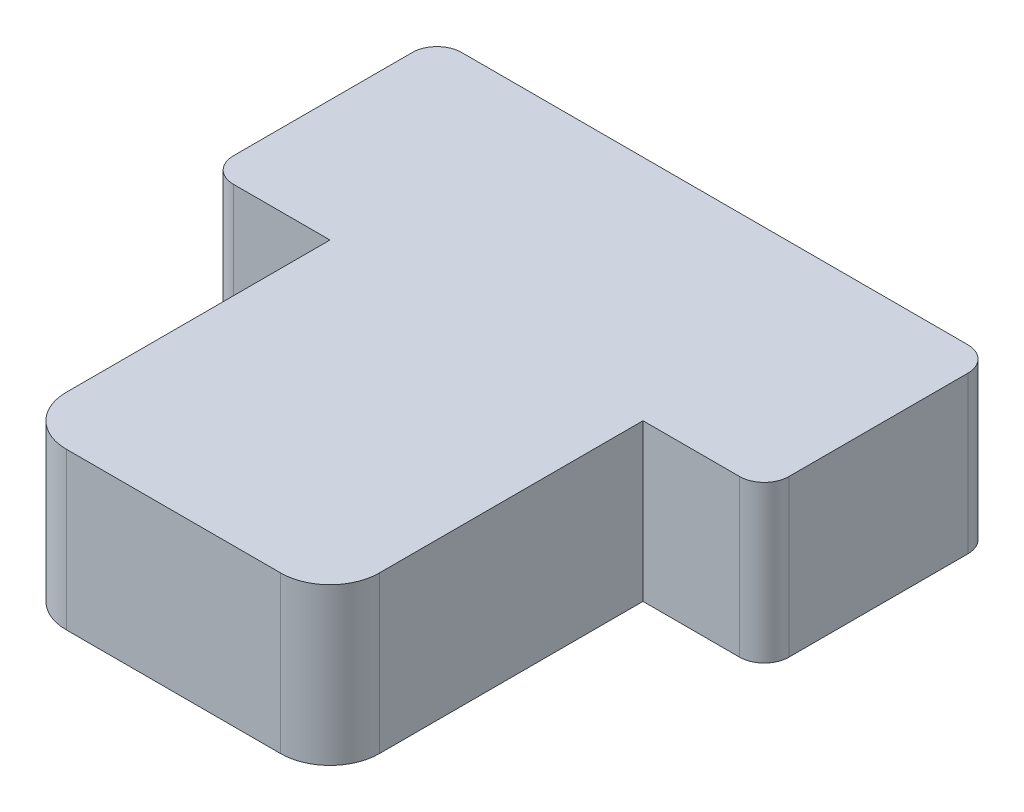
ISO-10303-21;
HEADER;
FILE_DESCRIPTION(('STEP AP214'),'2;1');
FILE_NAME('part.step','',(''),(''),'','','');
FILE_SCHEMA(('AUTOMOTIVE_DESIGN { 1 0 10303 214 1 1 1 1 }'));
ENDSEC;
DATA;
#1=APPLICATION_CONTEXT('core data for automotive mechanical design processes');
#2=APPLICATION_PROTOCOL_DEFINITION('international standard','automotive_design',2000,#1);
#3=PRODUCT_CONTEXT('',#1,'mechanical');
#4=PRODUCT('Part','Part','',(#3));
#5=PRODUCT_RELATED_PRODUCT_CATEGORY('part','',(#4));
#6=PRODUCT_DEFINITION_FORMATION('','',#4);
#7=PRODUCT_DEFINITION_CONTEXT('part definition',#1,'design');
#8=PRODUCT_DEFINITION('design','',#6,#7);
#9=PRODUCT_DEFINITION_SHAPE('','',#8);
#10=(LENGTH_UNIT() NAMED_UNIT(*) SI_UNIT(.MILLI.,.METRE.));
#11=(NAMED_UNIT(*) PLANE_ANGLE_UNIT() SI_UNIT($,.RADIAN.));
#12=(NAMED_UNIT(*) SI_UNIT($,.STERADIAN.) SOLID_ANGLE_UNIT());
#13=UNCERTAINTY_MEASURE_WITH_UNIT(LENGTH_MEASURE(1.E-05),#10,'distance_accuracy_value','');
#14=(GEOMETRIC_REPRESENTATION_CONTEXT(3) GLOBAL_UNCERTAINTY_ASSIGNED_CONTEXT((#13)) GLOBAL_UNIT_ASSIGNED_CONTEXT((#10,
#11,#12)) REPRESENTATION_CONTEXT('',''));
#15=CARTESIAN_POINT('',(0.,0.,0.));
#16=DIRECTION('',(0.,0.,1.));
#17=DIRECTION('',(1.,0.,0.));
#18=AXIS2_PLACEMENT_3D('',#15,#16,#17);
#19=CARTESIAN_POINT('',(0.,3.175,0.));
#20=DIRECTION('',(1.,0.,0.));
#21=DIRECTION('',(0.,0.,-1.));
#22=AXIS2_PLACEMENT_3D('',#19,#20,#21);
#23=PLANE('',#22);
#24=DIRECTION('',(0.,0.,1.));
#25=VECTOR('',#24,1.);
#26=CARTESIAN_POINT('',(0.,0.,0.));
#27=LINE('',#26,#25);
#28=CARTESIAN_POINT('',(0.,0.,-6.35));
#29=VERTEX_POINT('',#28);
#30=CARTESIAN_POINT('',(0.,0.,-1.));
#31=VERTEX_POINT('',#30);
#32=EDGE_CURVE('E174',#29,#31,#27,.T.);
#33=ORIENTED_EDGE('',*,*,#32,.T.);
#34=DIRECTION('',(0.,-1.,0.));
#35=VECTOR('',#34,1.);
#36=CARTESIAN_POINT('',(0.,3.175,-1.));
#37=LINE('',#36,#35);
#38=CARTESIAN_POINT('',(0.,3.175,-1.));
#39=VERTEX_POINT('',#38);
#40=EDGE_CURVE('E204',#31,#39,#37,.F.);
#41=ORIENTED_EDGE('',*,*,#40,.T.);
#42=DIRECTION('',(0.,0.,1.));
#43=VECTOR('',#42,1.);
#44=CARTESIAN_POINT('',(0.,3.175,0.));
#45=LINE('',#44,#43);
#46=CARTESIAN_POINT('',(0.,3.175,-6.35));
#47=VERTEX_POINT('',#46);
#48=EDGE_CURVE('E193',#47,#39,#45,.T.);
#49=ORIENTED_EDGE('',*,*,#48,.F.);
#50=DIRECTION('',(0.,-1.,0.));
#51=VECTOR('',#50,1.);
#52=CARTESIAN_POINT('',(0.,3.175,-6.35));
#53=LINE('',#52,#51);
#54=EDGE_CURVE('E159',#47,#29,#53,.T.);
#55=ORIENTED_EDGE('',*,*,#54,.T.);
#56=EDGE_LOOP('',(#33,#41,#49,#55));
#57=FACE_BOUND('',#56,.T.);
#58=ADVANCED_FACE('F34',(#57),#23,.F.);
#59=CARTESIAN_POINT('',(0.,3.175,0.));
#60=DIRECTION('',(0.,0.,-1.));
#61=DIRECTION('',(-1.,0.,0.));
#62=AXIS2_PLACEMENT_3D('',#59,#60,#61);
#63=PLANE('',#62);
#64=DIRECTION('',(1.,0.,0.));
#65=VECTOR('',#64,1.);
#66=CARTESIAN_POINT('',(0.,3.175,0.));
#67=LINE('',#66,#65);
#68=CARTESIAN_POINT('',(0.999999999999999,3.175,0.));
#69=VERTEX_POINT('',#68);
#70=CARTESIAN_POINT('',(5.35,3.175,0.));
#71=VERTEX_POINT('',#70);
#72=EDGE_CURVE('E148',#69,#71,#67,.T.);
#73=ORIENTED_EDGE('',*,*,#72,.F.);
#74=DIRECTION('',(0.,-1.,0.));
#75=VECTOR('',#74,1.);
#76=CARTESIAN_POINT('',(1.,3.175,0.));
#77=LINE('',#76,#75);
#78=CARTESIAN_POINT('',(0.999999999999999,0.,0.));
#79=VERTEX_POINT('',#78);
#80=EDGE_CURVE('E197',#69,#79,#77,.T.);
#81=ORIENTED_EDGE('',*,*,#80,.T.);
#82=DIRECTION('',(1.,0.,0.));
#83=VECTOR('',#82,1.);
#84=CARTESIAN_POINT('',(0.,0.,0.));
#85=LINE('',#84,#83);
#86=CARTESIAN_POINT('',(5.35,0.,0.));
#87=VERTEX_POINT('',#86);
#88=EDGE_CURVE('E177',#79,#87,#85,.T.);
#89=ORIENTED_EDGE('',*,*,#88,.T.);
#90=DIRECTION('',(0.,-1.,0.));
#91=VECTOR('',#90,1.);
#92=CARTESIAN_POINT('',(5.35,3.175,0.));
#93=LINE('',#92,#91);
#94=EDGE_CURVE('E158',#87,#71,#93,.F.);
#95=ORIENTED_EDGE('',*,*,#94,.T.);
#96=EDGE_LOOP('',(#73,#81,#89,#95));
#97=FACE_BOUND('',#96,.T.);
#98=ADVANCED_FACE('F283',(#97),#63,.F.);
#99=CARTESIAN_POINT('',(6.35,3.175,0.));
#100=DIRECTION('',(-1.,0.,0.));
#101=DIRECTION('',(0.,0.,1.));
#102=AXIS2_PLACEMENT_3D('',#99,#100,#101);
#103=PLANE('',#102);
#104=DIRECTION('',(0.,0.,-1.));
#105=VECTOR('',#104,1.);
#106=CARTESIAN_POINT('',(6.35,3.175,0.));
#107=LINE('',#106,#105);
#108=CARTESIAN_POINT('',(6.35,3.175,-1.));
#109=VERTEX_POINT('',#108);
#110=CARTESIAN_POINT('',(6.35,3.175,-6.35));
#111=VERTEX_POINT('',#110);
#112=EDGE_CURVE('E135',#109,#111,#107,.T.);
#113=ORIENTED_EDGE('',*,*,#112,.F.);
#114=DIRECTION('',(0.,-1.,0.));
#115=VECTOR('',#114,1.);
#116=CARTESIAN_POINT('',(6.35,3.175,-1.));
#117=LINE('',#116,#115);
#118=CARTESIAN_POINT('',(6.35,0.,-1.));
#119=VERTEX_POINT('',#118);
#120=EDGE_CURVE('E209',#109,#119,#117,.T.);
#121=ORIENTED_EDGE('',*,*,#120,.T.);
#122=DIRECTION('',(0.,0.,-1.));
#123=VECTOR('',#122,1.);
#124=CARTESIAN_POINT('',(6.35,0.,0.));
#125=LINE('',#124,#123);
#126=CARTESIAN_POINT('',(6.35,0.,-6.35));
#127=VERTEX_POINT('',#126);
#128=EDGE_CURVE('E154',#119,#127,#125,.T.);
#129=ORIENTED_EDGE('',*,*,#128,.T.);
#130=DIRECTION('',(0.,-1.,0.));
#131=VECTOR('',#130,1.);
#132=CARTESIAN_POINT('',(6.35,3.175,-6.35));
#133=LINE('',#132,#131);
#134=EDGE_CURVE('E151',#111,#127,#133,.T.);
#135=ORIENTED_EDGE('',*,*,#134,.F.);
#136=EDGE_LOOP('',(#113,#121,#129,#135));
#137=FACE_BOUND('',#136,.T.);
#138=ADVANCED_FACE('F152',(#137),#103,.F.);
#139=CARTESIAN_POINT('',(6.35,3.175,-6.35));
#140=DIRECTION('',(0.,0.,-1.));
#141=DIRECTION('',(-1.,0.,0.));
#142=AXIS2_PLACEMENT_3D('',#139,#140,#141);
#143=PLANE('',#142);
#144=DIRECTION('',(1.,0.,0.));
#145=VECTOR('',#144,1.);
#146=CARTESIAN_POINT('',(6.35,0.,-6.35));
#147=LINE('',#146,#145);
#148=CARTESIAN_POINT('',(8.31,0.,-6.35));
#149=VERTEX_POINT('',#148);
#150=EDGE_CURVE('E181',#127,#149,#147,.T.);
#151=ORIENTED_EDGE('',*,*,#150,.T.);
#152=DIRECTION('',(0.,-1.,0.));
#153=VECTOR('',#152,1.);
#154=CARTESIAN_POINT('',(8.31,3.175,-6.35));
#155=LINE('',#154,#153);
#156=CARTESIAN_POINT('',(8.31,3.175,-6.35));
#157=VERTEX_POINT('',#156);
#158=EDGE_CURVE('E11',#149,#157,#155,.F.);
#159=ORIENTED_EDGE('',*,*,#158,.T.);
#160=DIRECTION('',(1.,0.,0.));
#161=VECTOR('',#160,1.);
#162=CARTESIAN_POINT('',(6.35,3.175,-6.35));
#163=LINE('',#162,#161);
#164=EDGE_CURVE('E140',#111,#157,#163,.T.);
#165=ORIENTED_EDGE('',*,*,#164,.F.);
#166=ORIENTED_EDGE('',*,*,#134,.T.);
#167=EDGE_LOOP('',(#151,#159,#165,#166));
#168=FACE_BOUND('',#167,.T.);
#169=ADVANCED_FACE('F161',(#168),#143,.F.);
#170=CARTESIAN_POINT('',(8.81,3.175,-10.9807274));
#171=DIRECTION('',(-1.,0.,0.));
#172=DIRECTION('',(0.,0.,1.));
#173=AXIS2_PLACEMENT_3D('',#170,#171,#172);
#174=PLANE('',#173);
#175=DIRECTION('',(0.,0.,-1.));
#176=VECTOR('',#175,1.);
#177=CARTESIAN_POINT('',(8.81,0.,-10.9807274));
#178=LINE('',#177,#176);
#179=CARTESIAN_POINT('',(8.81,0.,-6.85));
#180=VERTEX_POINT('',#179);
#181=CARTESIAN_POINT('',(8.81,0.,-10.4807274));
#182=VERTEX_POINT('',#181);
#183=EDGE_CURVE('E183',#180,#182,#178,.T.);
#184=ORIENTED_EDGE('',*,*,#183,.T.);
#185=DIRECTION('',(0.,-1.,0.));
#186=VECTOR('',#185,1.);
#187=CARTESIAN_POINT('',(8.81,3.175,-10.4807274));
#188=LINE('',#187,#186);
#189=CARTESIAN_POINT('',(8.81,3.175,-10.4807274));
#190=VERTEX_POINT('',#189);
#191=EDGE_CURVE('E42',#182,#190,#188,.F.);
#192=ORIENTED_EDGE('',*,*,#191,.T.);
#193=DIRECTION('',(0.,0.,-1.));
#194=VECTOR('',#193,1.);
#195=CARTESIAN_POINT('',(8.81,3.175,-10.9807274));
#196=LINE('',#195,#194);
#197=CARTESIAN_POINT('',(8.81,3.175,-6.85));
#198=VERTEX_POINT('',#197);
#199=EDGE_CURVE('E163',#198,#190,#196,.T.);
#200=ORIENTED_EDGE('',*,*,#199,.F.);
#201=DIRECTION('',(0.,-1.,0.));
#202=VECTOR('',#201,1.);
#203=CARTESIAN_POINT('',(8.81,3.175,-6.85));
#204=LINE('',#203,#202);
#205=EDGE_CURVE('E238',#198,#180,#204,.T.);
#206=ORIENTED_EDGE('',*,*,#205,.T.);
#207=EDGE_LOOP('',(#184,#192,#200,#206));
#208=FACE_BOUND('',#207,.T.);
#209=ADVANCED_FACE('F243',(#208),#174,.F.);
#210=CARTESIAN_POINT('',(-2.46,3.175,-10.9807274));
#211=DIRECTION('',(0.,0.,1.));
#212=DIRECTION('',(1.,0.,0.));
#213=AXIS2_PLACEMENT_3D('',#210,#211,#212);
#214=PLANE('',#213);
#215=DIRECTION('',(-1.,0.,0.));
#216=VECTOR('',#215,1.);
#217=CARTESIAN_POINT('',(-2.46,0.,-10.9807274));
#218=LINE('',#217,#216);
#219=CARTESIAN_POINT('',(8.31,0.,-10.9807274));
#220=VERTEX_POINT('',#219);
#221=CARTESIAN_POINT('',(-1.96,0.,-10.9807274));
#222=VERTEX_POINT('',#221);
#223=EDGE_CURVE('E186',#220,#222,#218,.T.);
#224=ORIENTED_EDGE('',*,*,#223,.T.);
#225=DIRECTION('',(0.,-1.,0.));
#226=VECTOR('',#225,1.);
#227=CARTESIAN_POINT('',(-1.96,3.175,-10.9807274));
#228=LINE('',#227,#226);
#229=CARTESIAN_POINT('',(-1.96,3.175,-10.9807274));
#230=VERTEX_POINT('',#229);
#231=EDGE_CURVE('E49',#222,#230,#228,.F.);
#232=ORIENTED_EDGE('',*,*,#231,.T.);
#233=DIRECTION('',(-1.,0.,0.));
#234=VECTOR('',#233,1.);
#235=CARTESIAN_POINT('',(-2.46,3.175,-10.9807274));
#236=LINE('',#235,#234);
#237=CARTESIAN_POINT('',(8.31,3.175,-10.9807274));
#238=VERTEX_POINT('',#237);
#239=EDGE_CURVE('E165',#238,#230,#236,.T.);
#240=ORIENTED_EDGE('',*,*,#239,.F.);
#241=DIRECTION('',(0.,-1.,0.));
#242=VECTOR('',#241,1.);
#243=CARTESIAN_POINT('',(8.31,3.175,-10.9807274));
#244=LINE('',#243,#242);
#245=EDGE_CURVE('E234',#238,#220,#244,.T.);
#246=ORIENTED_EDGE('',*,*,#245,.T.);
#247=EDGE_LOOP('',(#224,#232,#240,#246));
#248=FACE_BOUND('',#247,.T.);
#249=ADVANCED_FACE('F250',(#248),#214,.F.);
#250=CARTESIAN_POINT('',(-2.46,3.175,-10.9807274));
#251=DIRECTION('',(1.,0.,0.));
#252=DIRECTION('',(0.,0.,-1.));
#253=AXIS2_PLACEMENT_3D('',#250,#251,#252);
#254=PLANE('',#253);
#255=DIRECTION('',(0.,0.,1.));
#256=VECTOR('',#255,1.);
#257=CARTESIAN_POINT('',(-2.46,0.,-10.9807274));
#258=LINE('',#257,#256);
#259=CARTESIAN_POINT('',(-2.46,0.,-10.4807274));
#260=VERTEX_POINT('',#259);
#261=CARTESIAN_POINT('',(-2.46,0.,-6.85));
#262=VERTEX_POINT('',#261);
#263=EDGE_CURVE('E188',#260,#262,#258,.T.);
#264=ORIENTED_EDGE('',*,*,#263,.T.);
#265=DIRECTION('',(0.,-1.,0.));
#266=VECTOR('',#265,1.);
#267=CARTESIAN_POINT('',(-2.46,3.175,-6.85));
#268=LINE('',#267,#266);
#269=CARTESIAN_POINT('',(-2.46,3.175,-6.85));
#270=VERTEX_POINT('',#269);
#271=EDGE_CURVE('E225',#262,#270,#268,.F.);
#272=ORIENTED_EDGE('',*,*,#271,.T.);
#273=DIRECTION('',(0.,0.,1.));
#274=VECTOR('',#273,1.);
#275=CARTESIAN_POINT('',(-2.46,3.175,-10.9807274));
#276=LINE('',#275,#274);
#277=CARTESIAN_POINT('',(-2.46,3.175,-10.4807274));
#278=VERTEX_POINT('',#277);
#279=EDGE_CURVE('E170',#278,#270,#276,.T.);
#280=ORIENTED_EDGE('',*,*,#279,.F.);
#281=DIRECTION('',(0.,-1.,0.));
#282=VECTOR('',#281,1.);
#283=CARTESIAN_POINT('',(-2.46,3.175,-10.4807274));
#284=LINE('',#283,#282);
#285=EDGE_CURVE('E222',#278,#260,#284,.T.);
#286=ORIENTED_EDGE('',*,*,#285,.T.);
#287=EDGE_LOOP('',(#264,#272,#280,#286));
#288=FACE_BOUND('',#287,.T.);
#289=ADVANCED_FACE('F261',(#288),#254,.F.);
#290=CARTESIAN_POINT('',(-2.46,3.175,-6.35));
#291=DIRECTION('',(0.,0.,-1.));
#292=DIRECTION('',(-1.,0.,0.));
#293=AXIS2_PLACEMENT_3D('',#290,#291,#292);
#294=PLANE('',#293);
#295=DIRECTION('',(1.,0.,0.));
#296=VECTOR('',#295,1.);
#297=CARTESIAN_POINT('',(-2.46,3.175,-6.35));
#298=LINE('',#297,#296);
#299=CARTESIAN_POINT('',(-1.96,3.175,-6.35));
#300=VERTEX_POINT('',#299);
#301=EDGE_CURVE('E172',#300,#47,#298,.T.);
#302=ORIENTED_EDGE('',*,*,#301,.F.);
#303=DIRECTION('',(0.,-1.,0.));
#304=VECTOR('',#303,1.);
#305=CARTESIAN_POINT('',(-1.96,3.175,-6.35));
#306=LINE('',#305,#304);
#307=CARTESIAN_POINT('',(-1.96,0.,-6.35));
#308=VERTEX_POINT('',#307);
#309=EDGE_CURVE('E211',#300,#308,#306,.T.);
#310=ORIENTED_EDGE('',*,*,#309,.T.);
#311=DIRECTION('',(1.,0.,0.));
#312=VECTOR('',#311,1.);
#313=CARTESIAN_POINT('',(-2.46,0.,-6.35));
#314=LINE('',#313,#312);
#315=EDGE_CURVE('E191',#308,#29,#314,.T.);
#316=ORIENTED_EDGE('',*,*,#315,.T.);
#317=ORIENTED_EDGE('',*,*,#54,.F.);
#318=EDGE_LOOP('',(#302,#310,#316,#317));
#319=FACE_BOUND('',#318,.T.);
#320=ADVANCED_FACE('F269',(#319),#294,.F.);
#321=CARTESIAN_POINT('',(0.,3.175,0.));
#322=DIRECTION('',(0.,-1.,0.));
#323=DIRECTION('',(0.,0.,-1.));
#324=AXIS2_PLACEMENT_3D('',#321,#322,#323);
#325=PLANE('',#324);
#326=ORIENTED_EDGE('',*,*,#279,.T.);
#327=CARTESIAN_POINT('',(-1.96,3.175,-6.85));
#328=DIRECTION('',(0.,-1.,0.));
#329=DIRECTION('',(0.,0.,-1.));
#330=AXIS2_PLACEMENT_3D('',#327,#328,#329);
#331=CIRCLE('',#330,0.5);
#332=EDGE_CURVE('E232',#270,#300,#331,.F.);
#333=ORIENTED_EDGE('',*,*,#332,.T.);
#334=ORIENTED_EDGE('',*,*,#301,.T.);
#335=ORIENTED_EDGE('',*,*,#48,.T.);
#336=CARTESIAN_POINT('',(1.,3.175,-1.));
#337=DIRECTION('',(0.,-1.,0.));
#338=DIRECTION('',(0.,0.,-1.));
#339=AXIS2_PLACEMENT_3D('',#336,#337,#338);
#340=CIRCLE('',#339,1.);
#341=EDGE_CURVE('E207',#39,#69,#340,.F.);
#342=ORIENTED_EDGE('',*,*,#341,.T.);
#343=ORIENTED_EDGE('',*,*,#72,.T.);
#344=CARTESIAN_POINT('',(5.35,3.175,-1.));
#345=DIRECTION('',(0.,-1.,0.));
#346=DIRECTION('',(0.,0.,-1.));
#347=AXIS2_PLACEMENT_3D('',#344,#345,#346);
#348=CIRCLE('',#347,1.);
#349=EDGE_CURVE('E144',#71,#109,#348,.F.);
#350=ORIENTED_EDGE('',*,*,#349,.T.);
#351=ORIENTED_EDGE('',*,*,#112,.T.);
#352=ORIENTED_EDGE('',*,*,#164,.T.);
#353=CARTESIAN_POINT('',(8.31,3.175,-6.85));
#354=DIRECTION('',(0.,-1.,0.));
#355=DIRECTION('',(0.,0.,-1.));
#356=AXIS2_PLACEMENT_3D('',#353,#354,#355);
#357=CIRCLE('',#356,0.5);
#358=EDGE_CURVE('E227',#157,#198,#357,.F.);
#359=ORIENTED_EDGE('',*,*,#358,.T.);
#360=ORIENTED_EDGE('',*,*,#199,.T.);
#361=CARTESIAN_POINT('',(8.31,3.175,-10.4807274));
#362=DIRECTION('',(0.,-1.,0.));
#363=DIRECTION('',(0.,0.,-1.));
#364=AXIS2_PLACEMENT_3D('',#361,#362,#363);
#365=CIRCLE('',#364,0.5);
#366=EDGE_CURVE('E56',#190,#238,#365,.F.);
#367=ORIENTED_EDGE('',*,*,#366,.T.);
#368=ORIENTED_EDGE('',*,*,#239,.T.);
#369=CARTESIAN_POINT('',(-1.96,3.175,-10.4807274));
#370=DIRECTION('',(0.,-1.,0.));
#371=DIRECTION('',(0.,0.,-1.));
#372=AXIS2_PLACEMENT_3D('',#369,#370,#371);
#373=CIRCLE('',#372,0.5);
#374=EDGE_CURVE('E230',#230,#278,#373,.F.);
#375=ORIENTED_EDGE('',*,*,#374,.T.);
#376=EDGE_LOOP('',(#326,#333,#334,#335,#342,#343,#350,#351,#352,#359,#360,#367,#368,#375));
#377=FACE_BOUND('',#376,.T.);
#378=ADVANCED_FACE('F138',(#377),#325,.F.);
#379=CARTESIAN_POINT('',(0.,0.,0.));
#380=DIRECTION('',(0.,-1.,0.));
#381=DIRECTION('',(0.,0.,-1.));
#382=AXIS2_PLACEMENT_3D('',#379,#380,#381);
#383=PLANE('',#382);
#384=ORIENTED_EDGE('',*,*,#315,.F.);
#385=CARTESIAN_POINT('',(-1.96,0.,-6.85));
#386=DIRECTION('',(0.,-1.,0.));
#387=DIRECTION('',(0.,0.,-1.));
#388=AXIS2_PLACEMENT_3D('',#385,#386,#387);
#389=CIRCLE('',#388,0.5);
#390=EDGE_CURVE('E220',#308,#262,#389,.T.);
#391=ORIENTED_EDGE('',*,*,#390,.T.);
#392=ORIENTED_EDGE('',*,*,#263,.F.);
#393=CARTESIAN_POINT('',(-1.96,0.,-10.4807274));
#394=DIRECTION('',(0.,-1.,0.));
#395=DIRECTION('',(0.,0.,-1.));
#396=AXIS2_PLACEMENT_3D('',#393,#394,#395);
#397=CIRCLE('',#396,0.5);
#398=EDGE_CURVE('E218',#260,#222,#397,.T.);
#399=ORIENTED_EDGE('',*,*,#398,.T.);
#400=ORIENTED_EDGE('',*,*,#223,.F.);
#401=CARTESIAN_POINT('',(8.31,0.,-10.4807274));
#402=DIRECTION('',(0.,-1.,0.));
#403=DIRECTION('',(0.,0.,-1.));
#404=AXIS2_PLACEMENT_3D('',#401,#402,#403);
#405=CIRCLE('',#404,0.5);
#406=EDGE_CURVE('E216',#220,#182,#405,.T.);
#407=ORIENTED_EDGE('',*,*,#406,.T.);
#408=ORIENTED_EDGE('',*,*,#183,.F.);
#409=CARTESIAN_POINT('',(8.31,0.,-6.85));
#410=DIRECTION('',(0.,-1.,0.));
#411=DIRECTION('',(0.,0.,-1.));
#412=AXIS2_PLACEMENT_3D('',#409,#410,#411);
#413=CIRCLE('',#412,0.5);
#414=EDGE_CURVE('E214',#180,#149,#413,.T.);
#415=ORIENTED_EDGE('',*,*,#414,.T.);
#416=ORIENTED_EDGE('',*,*,#150,.F.);
#417=ORIENTED_EDGE('',*,*,#128,.F.);
#418=CARTESIAN_POINT('',(5.35,0.,-1.));
#419=DIRECTION('',(0.,-1.,0.));
#420=DIRECTION('',(0.,0.,-1.));
#421=AXIS2_PLACEMENT_3D('',#418,#419,#420);
#422=CIRCLE('',#421,1.);
#423=EDGE_CURVE('E200',#119,#87,#422,.T.);
#424=ORIENTED_EDGE('',*,*,#423,.T.);
#425=ORIENTED_EDGE('',*,*,#88,.F.);
#426=CARTESIAN_POINT('',(1.,0.,-1.));
#427=DIRECTION('',(0.,-1.,0.));
#428=DIRECTION('',(0.,0.,-1.));
#429=AXIS2_PLACEMENT_3D('',#426,#427,#428);
#430=CIRCLE('',#429,1.);
#431=EDGE_CURVE('E202',#79,#31,#430,.T.);
#432=ORIENTED_EDGE('',*,*,#431,.T.);
#433=ORIENTED_EDGE('',*,*,#32,.F.);
#434=EDGE_LOOP('',(#384,#391,#392,#399,#400,#407,#408,#415,#416,#417,#424,#425,#432,#433));
#435=FACE_BOUND('',#434,.T.);
#436=ADVANCED_FACE('F253',(#435),#383,.T.);
#437=CARTESIAN_POINT('',(1.,3.175,-1.));
#438=DIRECTION('',(0.,-1.,0.));
#439=DIRECTION('',(0.,0.,-1.));
#440=AXIS2_PLACEMENT_3D('',#437,#438,#439);
#441=CYLINDRICAL_SURFACE('',#440,1.);
#442=ORIENTED_EDGE('',*,*,#341,.F.);
#443=ORIENTED_EDGE('',*,*,#40,.F.);
#444=ORIENTED_EDGE('',*,*,#431,.F.);
#445=ORIENTED_EDGE('',*,*,#80,.F.);
#446=EDGE_LOOP('',(#442,#443,#444,#445));
#447=FACE_BOUND('',#446,.T.);
#448=ADVANCED_FACE('F279',(#447),#441,.T.);
#449=CARTESIAN_POINT('',(5.35,3.175,-1.));
#450=DIRECTION('',(0.,-1.,0.));
#451=DIRECTION('',(0.,0.,-1.));
#452=AXIS2_PLACEMENT_3D('',#449,#450,#451);
#453=CYLINDRICAL_SURFACE('',#452,1.);
#454=ORIENTED_EDGE('',*,*,#349,.F.);
#455=ORIENTED_EDGE('',*,*,#94,.F.);
#456=ORIENTED_EDGE('',*,*,#423,.F.);
#457=ORIENTED_EDGE('',*,*,#120,.F.);
#458=EDGE_LOOP('',(#454,#455,#456,#457));
#459=FACE_BOUND('',#458,.T.);
#460=ADVANCED_FACE('F287',(#459),#453,.T.);
#461=CARTESIAN_POINT('',(-1.96,3.175,-6.85));
#462=DIRECTION('',(0.,-1.,0.));
#463=DIRECTION('',(0.,0.,-1.));
#464=AXIS2_PLACEMENT_3D('',#461,#462,#463);
#465=CYLINDRICAL_SURFACE('',#464,0.5);
#466=ORIENTED_EDGE('',*,*,#332,.F.);
#467=ORIENTED_EDGE('',*,*,#271,.F.);
#468=ORIENTED_EDGE('',*,*,#390,.F.);
#469=ORIENTED_EDGE('',*,*,#309,.F.);
#470=EDGE_LOOP('',(#466,#467,#468,#469));
#471=FACE_BOUND('',#470,.T.);
#472=ADVANCED_FACE('F267',(#471),#465,.T.);
#473=CARTESIAN_POINT('',(-1.96,3.175,-10.4807274));
#474=DIRECTION('',(0.,-1.,0.));
#475=DIRECTION('',(0.,0.,-1.));
#476=AXIS2_PLACEMENT_3D('',#473,#474,#475);
#477=CYLINDRICAL_SURFACE('',#476,0.5);
#478=ORIENTED_EDGE('',*,*,#374,.F.);
#479=ORIENTED_EDGE('',*,*,#231,.F.);
#480=ORIENTED_EDGE('',*,*,#398,.F.);
#481=ORIENTED_EDGE('',*,*,#285,.F.);
#482=EDGE_LOOP('',(#478,#479,#480,#481));
#483=FACE_BOUND('',#482,.T.);
#484=ADVANCED_FACE('F258',(#483),#477,.T.);
#485=CARTESIAN_POINT('',(8.31,3.175,-10.4807274));
#486=DIRECTION('',(0.,-1.,0.));
#487=DIRECTION('',(0.,0.,-1.));
#488=AXIS2_PLACEMENT_3D('',#485,#486,#487);
#489=CYLINDRICAL_SURFACE('',#488,0.5);
#490=ORIENTED_EDGE('',*,*,#366,.F.);
#491=ORIENTED_EDGE('',*,*,#191,.F.);
#492=ORIENTED_EDGE('',*,*,#406,.F.);
#493=ORIENTED_EDGE('',*,*,#245,.F.);
#494=EDGE_LOOP('',(#490,#491,#492,#493));
#495=FACE_BOUND('',#494,.T.);
#496=ADVANCED_FACE('F248',(#495),#489,.T.);
#497=CARTESIAN_POINT('',(8.31,3.175,-6.85));
#498=DIRECTION('',(0.,-1.,0.));
#499=DIRECTION('',(0.,0.,-1.));
#500=AXIS2_PLACEMENT_3D('',#497,#498,#499);
#501=CYLINDRICAL_SURFACE('',#500,0.5);
#502=ORIENTED_EDGE('',*,*,#358,.F.);
#503=ORIENTED_EDGE('',*,*,#158,.F.);
#504=ORIENTED_EDGE('',*,*,#414,.F.);
#505=ORIENTED_EDGE('',*,*,#205,.F.);
#506=EDGE_LOOP('',(#502,#503,#504,#505));
#507=FACE_BOUND('',#506,.T.);
#508=ADVANCED_FACE('F36',(#507),#501,.T.);
#509=CLOSED_SHELL('',(#58,#98,#138,#169,#209,#249,#289,#320,#378,#436,#448,#460,#472,#484,#496,#508));
#510=MANIFOLD_SOLID_BREP('B2',#509);
#511=ADVANCED_BREP_SHAPE_REPRESENTATION('',(#18,#510),#14);
#512=SHAPE_DEFINITION_REPRESENTATION(#9,#511);
ENDSEC;
END-ISO-10303-21;
